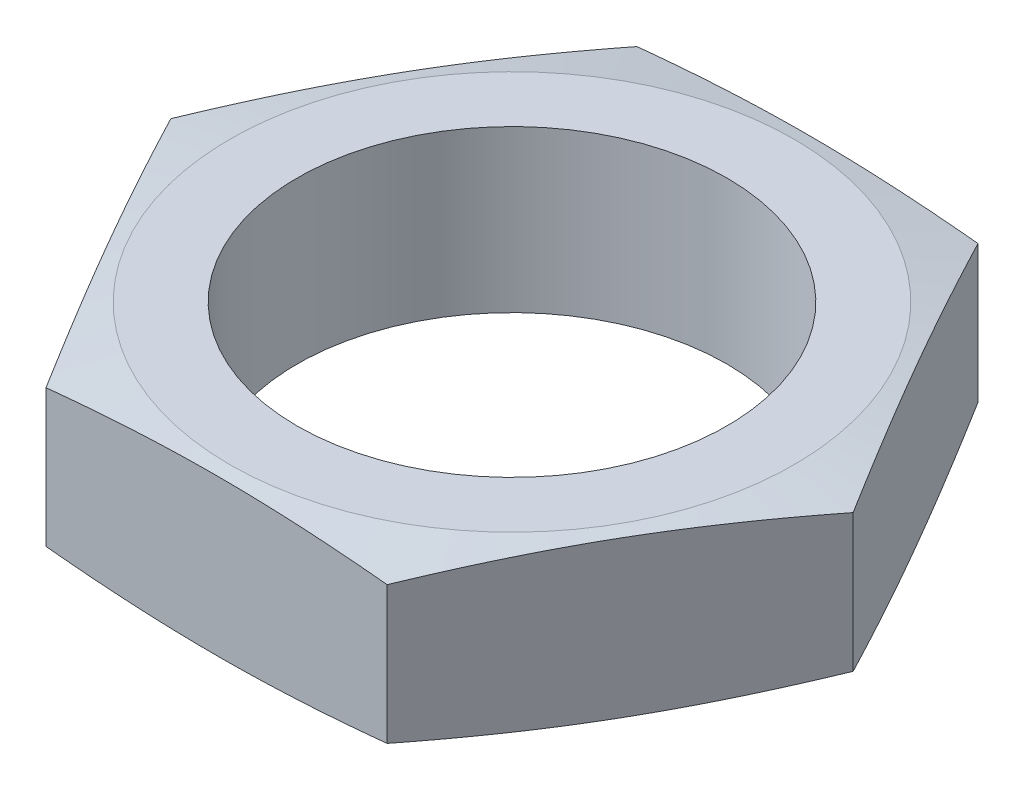
ISO-10303-21;
HEADER;
FILE_DESCRIPTION(('STEP AP214'),'2;1');
FILE_NAME('part.step','',(''),(''),'','','');
FILE_SCHEMA(('AUTOMOTIVE_DESIGN { 1 0 10303 214 1 1 1 1 }'));
ENDSEC;
DATA;
#1=APPLICATION_CONTEXT('core data for automotive mechanical design processes');
#2=APPLICATION_PROTOCOL_DEFINITION('international standard','automotive_design',2000,#1);
#3=PRODUCT_CONTEXT('',#1,'mechanical');
#4=PRODUCT('Part','Part','',(#3));
#5=PRODUCT_RELATED_PRODUCT_CATEGORY('part','',(#4));
#6=PRODUCT_DEFINITION_FORMATION('','',#4);
#7=PRODUCT_DEFINITION_CONTEXT('part definition',#1,'design');
#8=PRODUCT_DEFINITION('design','',#6,#7);
#9=PRODUCT_DEFINITION_SHAPE('','',#8);
#10=(LENGTH_UNIT() NAMED_UNIT(*) SI_UNIT(.MILLI.,.METRE.));
#11=(NAMED_UNIT(*) PLANE_ANGLE_UNIT() SI_UNIT($,.RADIAN.));
#12=(NAMED_UNIT(*) SI_UNIT($,.STERADIAN.) SOLID_ANGLE_UNIT());
#13=UNCERTAINTY_MEASURE_WITH_UNIT(LENGTH_MEASURE(1.E-05),#10,'distance_accuracy_value','');
#14=(GEOMETRIC_REPRESENTATION_CONTEXT(3) GLOBAL_UNCERTAINTY_ASSIGNED_CONTEXT((#13)) GLOBAL_UNIT_ASSIGNED_CONTEXT((#10,
#11,#12)) REPRESENTATION_CONTEXT('',''));
#15=CARTESIAN_POINT('',(0.,0.,0.));
#16=DIRECTION('',(0.,0.,1.));
#17=DIRECTION('',(1.,0.,0.));
#18=AXIS2_PLACEMENT_3D('',#15,#16,#17);
#19=CARTESIAN_POINT('',(0.,3.,0.));
#20=DIRECTION('',(0.,1.,0.));
#21=DIRECTION('',(0.,0.,1.));
#22=AXIS2_PLACEMENT_3D('',#19,#20,#21);
#23=PLANE('',#22);
#24=CARTESIAN_POINT('',(0.,3.,0.));
#25=DIRECTION('',(0.,1.,0.));
#26=DIRECTION('',(0.,0.,1.));
#27=AXIS2_PLACEMENT_3D('',#24,#25,#26);
#28=CIRCLE('',#27,10.5);
#29=CARTESIAN_POINT('',(0.,3.,10.5));
#30=VERTEX_POINT('',#29);
#31=EDGE_CURVE('E122',#30,#30,#28,.T.);
#32=ORIENTED_EDGE('',*,*,#31,.T.);
#33=EDGE_LOOP('',(#32));
#34=FACE_BOUND('',#33,.T.);
#35=CARTESIAN_POINT('',(0.,3.00000000000001,0.));
#36=DIRECTION('',(0.,-1.,0.));
#37=DIRECTION('',(0.,0.,-1.));
#38=AXIS2_PLACEMENT_3D('',#35,#36,#37);
#39=CIRCLE('',#38,7.99999999999999);
#40=CARTESIAN_POINT('',(0.,3.00000000000001,-7.99999999999999));
#41=VERTEX_POINT('',#40);
#42=EDGE_CURVE('E237',#41,#41,#39,.T.);
#43=ORIENTED_EDGE('',*,*,#42,.T.);
#44=EDGE_LOOP('',(#43));
#45=FACE_BOUND('',#44,.T.);
#46=ADVANCED_FACE('F39',(#34,#45),#23,.T.);
#47=CARTESIAN_POINT('',(-6.35085296108588,3.,11.));
#48=DIRECTION('',(0.,0.,-1.));
#49=DIRECTION('',(-1.,0.,0.));
#50=AXIS2_PLACEMENT_3D('',#47,#48,#49);
#51=PLANE('',#50);
#52=CARTESIAN_POINT('',(-16.7722922137977,-1.08846769373587,11.));
#53=CARTESIAN_POINT('',(-16.2731428790611,-1.17192389600639,11.));
#54=CARTESIAN_POINT('',(-15.773815035147,-1.25433135117265,11.));
#55=CARTESIAN_POINT('',(-14.7747162911989,-1.41649136006859,11.));
#56=CARTESIAN_POINT('',(-14.2749453805329,-1.49624384821549,11.));
#57=CARTESIAN_POINT('',(-13.2746248418894,-1.65257520195712,11.));
#58=CARTESIAN_POINT('',(-12.7740749371449,-1.72915230285825,11.));
#59=CARTESIAN_POINT('',(-11.7723848357964,-1.87834077674984,11.));
#60=CARTESIAN_POINT('',(-11.2712446420702,-1.95095216899286,11.));
#61=CARTESIAN_POINT('',(-10.2704536475722,-2.09098072255144,11.));
#62=CARTESIAN_POINT('',(-9.77080582472987,-2.15841906332748,11.));
#63=CARTESIAN_POINT('',(-8.77074083474428,-2.28731659611422,11.));
#64=CARTESIAN_POINT('',(-8.27032367720687,-2.34877586217311,11.));
#65=CARTESIAN_POINT('',(-7.26867167751493,-2.4643498072554,11.));
#66=CARTESIAN_POINT('',(-6.76743689763973,-2.5184650214607,11.));
#67=CARTESIAN_POINT('',(-5.76407587021504,-2.61778612121701,11.));
#68=CARTESIAN_POINT('',(-5.26194962291346,-2.6629920092452,11.));
#69=CARTESIAN_POINT('',(-4.25377044889399,-2.74305795887612,11.));
#70=CARTESIAN_POINT('',(-3.74771228901958,-2.77785305370227,11.));
#71=CARTESIAN_POINT('',(-2.73489238993153,-2.83510361352437,11.));
#72=CARTESIAN_POINT('',(-2.22813065884094,-2.85755921981686,11.));
#73=CARTESIAN_POINT('',(-1.21430051973899,-2.88890136845049,11.));
#74=CARTESIAN_POINT('',(-0.707232213610055,-2.89779114361509,11.));
#75=CARTESIAN_POINT('',(0.306956331119475,-2.90148064036396,11.));
#76=CARTESIAN_POINT('',(0.814076569683894,-2.89628037169709,11.));
#77=CARTESIAN_POINT('',(1.82900611868858,-2.87207936975535,11.));
#78=CARTESIAN_POINT('',(2.33681475195021,-2.85305078227715,11.));
#79=CARTESIAN_POINT('',(3.35178743836292,-2.80223714818586,11.));
#80=CARTESIAN_POINT('',(3.85895148451142,-2.7704519641577,11.));
#81=CARTESIAN_POINT('',(4.87261174495463,-2.69566930387817,11.));
#82=CARTESIAN_POINT('',(5.37910767647204,-2.6526680513658,11.));
#83=CARTESIAN_POINT('',(6.39119527652248,-2.55718152362848,11.));
#84=CARTESIAN_POINT('',(6.89678694316745,-2.50469622862455,11.));
#85=CARTESIAN_POINT('',(7.87840073102163,-2.3950939405448,11.));
#86=CARTESIAN_POINT('',(8.35447159936608,-2.33840922232469,11.));
#87=CARTESIAN_POINT('',(9.30589720015615,-2.21929115381757,11.));
#88=CARTESIAN_POINT('',(9.78125192090888,-2.15685771068027,11.));
#89=CARTESIAN_POINT('',(10.7313410470661,-2.02727503593882,11.));
#90=CARTESIAN_POINT('',(11.2060754176224,-1.96012555010951,11.));
#91=CARTESIAN_POINT('',(12.1549835611179,-1.82196489425272,11.));
#92=CARTESIAN_POINT('',(12.6291573296849,-1.75095369430813,11.));
#93=CARTESIAN_POINT('',(13.5770998048756,-1.60574910918428,11.));
#94=CARTESIAN_POINT('',(14.0508684274322,-1.53155517672329,11.));
#95=CARTESIAN_POINT('',(14.997988638859,-1.38054774151377,11.));
#96=CARTESIAN_POINT('',(15.4713402262632,-1.30373422959378,11.));
#97=CARTESIAN_POINT('',(16.8908239597901,-1.07006339582943,11.));
#98=CARTESIAN_POINT('',(17.8364231580177,-0.909969863418788,11.));
#99=CARTESIAN_POINT('',(19.7213978754908,-0.584652713470203,11.));
#100=CARTESIAN_POINT('',(20.6607791119927,-0.419462002800291,11.));
#101=CARTESIAN_POINT('',(22.5387809886883,-0.0847616117864468,11.));
#102=CARTESIAN_POINT('',(23.4774016205345,0.0847481153130264,11.));
#103=CARTESIAN_POINT('',(25.3533301149125,0.426816406325102,11.));
#104=CARTESIAN_POINT('',(26.2906384304818,0.599372491966795,11.));
#105=CARTESIAN_POINT('',(28.1647819690706,0.946933839393104,11.));
#106=CARTESIAN_POINT('',(29.1016172011011,1.1219390525533,11.));
#107=CARTESIAN_POINT('',(30.0382883250768,1.29780826690031,11.));
#108=B_SPLINE_CURVE_WITH_KNOTS('',3,(#52,#53,#54,#55,#56,#57,#58,#59,#60,#61,#62,#63,#64,#65,
#66,#67,#68,#69,#70,#71,#72,#73,#74,#75,#76,#77,#78,#79,#80,#81,#82,#83,#84,#85,#86,#87,#88,#89,
#90,#91,#92,#93,#94,#95,#96,#97,#98,#99,#100,#101,#102,#103,#104,#105,#106,#107),.UNSPECIFIED.,
.F.,.F.,(4,2,2,2,2,2,2,2,2,2,2,2,2,2,2,2,2,2,2,2,2,2,2,2,2,2,2,4),(0.,1.51823771290291,
3.03651290140394,4.55562084890165,6.07472142084195,7.58722770584801,9.09971525675225,
10.6120925291448,12.1244693810303,13.6460960345534,15.1677052639269,16.6889518275263,
18.21019733858,19.7345155982005,21.2588502783388,22.7836988401997,24.3085505821687,
25.7468102860364,27.1850932239686,28.623453754237,30.0618254292263,31.500445436424,
32.9390704809196,35.8162049637455,38.6775784631281,41.5389829515007,44.3981580934791,
47.2572765503519),.UNSPECIFIED.);
#109=CARTESIAN_POINT('',(6.35085296108589,-2.55965881556565,11.));
#110=VERTEX_POINT('',#109);
#111=CARTESIAN_POINT('',(-6.35085296108588,-2.55965881556565,11.));
#112=VERTEX_POINT('',#111);
#113=EDGE_CURVE('E58',#110,#112,#108,.F.);
#114=ORIENTED_EDGE('',*,*,#113,.F.);
#115=DIRECTION('',(0.,-1.,0.));
#116=VECTOR('',#115,1.);
#117=CARTESIAN_POINT('',(6.35085296108589,3.,11.));
#118=LINE('',#117,#116);
#119=CARTESIAN_POINT('',(6.35085296108589,2.55965881556565,11.));
#120=VERTEX_POINT('',#119);
#121=EDGE_CURVE('E51',#120,#110,#118,.T.);
#122=ORIENTED_EDGE('',*,*,#121,.F.);
#123=CARTESIAN_POINT('',(-16.7722922137977,1.08846769373587,11.));
#124=CARTESIAN_POINT('',(-16.2731428790611,1.17192389600639,11.));
#125=CARTESIAN_POINT('',(-15.773815035147,1.25433135117265,11.));
#126=CARTESIAN_POINT('',(-14.7747162911989,1.41649136006859,11.));
#127=CARTESIAN_POINT('',(-14.2749453805329,1.49624384821549,11.));
#128=CARTESIAN_POINT('',(-13.2746248418894,1.65257520195712,11.));
#129=CARTESIAN_POINT('',(-12.7740749371449,1.72915230285825,11.));
#130=CARTESIAN_POINT('',(-11.7723848357964,1.87834077674984,11.));
#131=CARTESIAN_POINT('',(-11.2712446420702,1.95095216899286,11.));
#132=CARTESIAN_POINT('',(-10.2704536475722,2.09098072255144,11.));
#133=CARTESIAN_POINT('',(-9.77080582472987,2.15841906332748,11.));
#134=CARTESIAN_POINT('',(-8.77074083474428,2.28731659611422,11.));
#135=CARTESIAN_POINT('',(-8.27032367720687,2.34877586217311,11.));
#136=CARTESIAN_POINT('',(-7.26867167751493,2.4643498072554,11.));
#137=CARTESIAN_POINT('',(-6.76743689763973,2.5184650214607,11.));
#138=CARTESIAN_POINT('',(-5.76407587021504,2.61778612121701,11.));
#139=CARTESIAN_POINT('',(-5.26194962291346,2.6629920092452,11.));
#140=CARTESIAN_POINT('',(-4.25377044889399,2.74305795887612,11.));
#141=CARTESIAN_POINT('',(-3.74771228901958,2.77785305370227,11.));
#142=CARTESIAN_POINT('',(-2.73489238993153,2.83510361352437,11.));
#143=CARTESIAN_POINT('',(-2.22813065884094,2.85755921981686,11.));
#144=CARTESIAN_POINT('',(-1.21430051973899,2.88890136845049,11.));
#145=CARTESIAN_POINT('',(-0.707232213610055,2.89779114361509,11.));
#146=CARTESIAN_POINT('',(0.306956331119475,2.90148064036396,11.));
#147=CARTESIAN_POINT('',(0.814076569683894,2.89628037169709,11.));
#148=CARTESIAN_POINT('',(1.82900611868858,2.87207936975535,11.));
#149=CARTESIAN_POINT('',(2.33681475195021,2.85305078227715,11.));
#150=CARTESIAN_POINT('',(3.35178743836292,2.80223714818586,11.));
#151=CARTESIAN_POINT('',(3.85895148451142,2.7704519641577,11.));
#152=CARTESIAN_POINT('',(4.87261174495463,2.69566930387817,11.));
#153=CARTESIAN_POINT('',(5.37910767647204,2.6526680513658,11.));
#154=CARTESIAN_POINT('',(6.39119527652248,2.55718152362848,11.));
#155=CARTESIAN_POINT('',(6.89678694316745,2.50469622862455,11.));
#156=CARTESIAN_POINT('',(7.87840073102163,2.3950939405448,11.));
#157=CARTESIAN_POINT('',(8.35447159936608,2.33840922232469,11.));
#158=CARTESIAN_POINT('',(9.30589720015615,2.21929115381757,11.));
#159=CARTESIAN_POINT('',(9.78125192090888,2.15685771068027,11.));
#160=CARTESIAN_POINT('',(10.7313410470661,2.02727503593882,11.));
#161=CARTESIAN_POINT('',(11.2060754176224,1.96012555010951,11.));
#162=CARTESIAN_POINT('',(12.1549835611179,1.82196489425272,11.));
#163=CARTESIAN_POINT('',(12.6291573296849,1.75095369430813,11.));
#164=CARTESIAN_POINT('',(13.5770998048756,1.60574910918428,11.));
#165=CARTESIAN_POINT('',(14.0508684274322,1.53155517672329,11.));
#166=CARTESIAN_POINT('',(14.997988638859,1.38054774151377,11.));
#167=CARTESIAN_POINT('',(15.4713402262632,1.30373422959378,11.));
#168=CARTESIAN_POINT('',(16.8908239597901,1.07006339582943,11.));
#169=CARTESIAN_POINT('',(17.8364231580177,0.909969863418788,11.));
#170=CARTESIAN_POINT('',(19.7213978754908,0.584652713470203,11.));
#171=CARTESIAN_POINT('',(20.6607791119927,0.419462002800291,11.));
#172=CARTESIAN_POINT('',(22.5387809886883,0.0847616117864468,11.));
#173=CARTESIAN_POINT('',(23.4774016205345,-0.0847481153130264,11.));
#174=CARTESIAN_POINT('',(25.3533301149125,-0.426816406325102,11.));
#175=CARTESIAN_POINT('',(26.2906384304818,-0.599372491966795,11.));
#176=CARTESIAN_POINT('',(28.1647819690706,-0.946933839393104,11.));
#177=CARTESIAN_POINT('',(29.1016172011011,-1.1219390525533,11.));
#178=CARTESIAN_POINT('',(30.0382883250768,-1.29780826690031,11.));
#179=B_SPLINE_CURVE_WITH_KNOTS('',3,(#123,#124,#125,#126,#127,#128,#129,#130,#131,#132,#133,
#134,#135,#136,#137,#138,#139,#140,#141,#142,#143,#144,#145,#146,#147,#148,#149,#150,#151,#152,
#153,#154,#155,#156,#157,#158,#159,#160,#161,#162,#163,#164,#165,#166,#167,#168,#169,#170,#171,
#172,#173,#174,#175,#176,#177,#178),.UNSPECIFIED.,.F.,.F.,(4,2,2,2,2,2,2,2,2,2,2,2,2,2,2,2,2,2,
2,2,2,2,2,2,2,2,2,4),(0.,1.51823771290291,3.03651290140394,4.55562084890165,6.07472142084195,
7.58722770584801,9.09971525675225,10.6120925291448,12.1244693810303,13.6460960345534,
15.1677052639269,16.6889518275263,18.21019733858,19.7345155982005,21.2588502783388,
22.7836988401997,24.3085505821687,25.7468102860364,27.1850932239686,28.623453754237,
30.0618254292263,31.500445436424,32.9390704809196,35.8162049637455,38.6775784631281,
41.5389829515007,44.3981580934791,47.2572765503519),.UNSPECIFIED.);
#180=CARTESIAN_POINT('',(-6.35085296108588,2.55965881556565,11.));
#181=VERTEX_POINT('',#180);
#182=EDGE_CURVE('E191',#181,#120,#179,.T.);
#183=ORIENTED_EDGE('',*,*,#182,.F.);
#184=DIRECTION('',(0.,-1.,0.));
#185=VECTOR('',#184,1.);
#186=CARTESIAN_POINT('',(-6.35085296108588,3.,11.));
#187=LINE('',#186,#185);
#188=EDGE_CURVE('E115',#181,#112,#187,.T.);
#189=ORIENTED_EDGE('',*,*,#188,.T.);
#190=EDGE_LOOP('',(#114,#122,#183,#189));
#191=FACE_BOUND('',#190,.T.);
#192=ADVANCED_FACE('F41',(#191),#51,.F.);
#193=CARTESIAN_POINT('',(6.35085296108589,3.,11.));
#194=DIRECTION('',(-0.866025403784439,0.,-0.5));
#195=DIRECTION('',(-0.5,0.,0.866025403784439));
#196=AXIS2_PLACEMENT_3D('',#193,#194,#195);
#197=PLANE('',#196);
#198=CARTESIAN_POINT('',(12.7018213922256,-2.55963572123997,-0.000200000000004378));
#199=CARTESIAN_POINT('',(12.4376877449327,-2.61248506587701,0.457292897099762));
#200=CARTESIAN_POINT('',(12.1732852687328,-2.66041191030217,0.915251419525077));
#201=CARTESIAN_POINT('',(11.6439595136675,-2.74455346101174,1.83207052105287));
#202=CARTESIAN_POINT('',(11.3790361326985,-2.78076557889539,2.2909312770042));
#203=CARTESIAN_POINT('',(10.849567212286,-2.83950067027059,3.20799834818716));
#204=CARTESIAN_POINT('',(10.5850227887311,-2.8620628466017,3.66620273064335));
#205=CARTESIAN_POINT('',(10.0557453755322,-2.89231173135483,4.5829381016024));
#206=CARTESIAN_POINT('',(9.79101240858053,-2.9,5.0414690508012));
#207=CARTESIAN_POINT('',(9.26154647467713,-2.9,5.9585309491988));
#208=CARTESIAN_POINT('',(8.99681350772543,-2.89231173135483,6.4170618983976));
#209=CARTESIAN_POINT('',(8.46753609452657,-2.8620628466017,7.33379726935665));
#210=CARTESIAN_POINT('',(8.20299167097162,-2.83950067027059,7.79200165181284));
#211=CARTESIAN_POINT('',(7.6735227505592,-2.78076557889539,8.70906872299579));
#212=CARTESIAN_POINT('',(7.40859936959014,-2.74455346101174,9.16792947894713));
#213=CARTESIAN_POINT('',(6.87927361452488,-2.66041191030217,10.0847485804749));
#214=CARTESIAN_POINT('',(6.61487113832494,-2.61248506587701,10.5427071029002));
#215=CARTESIAN_POINT('',(6.35073749103205,-2.55963572123996,11.0002));
#216=B_SPLINE_CURVE_WITH_KNOTS('',3,(#198,#199,#200,#201,#202,#203,#204,#205,#206,#207,#208,
#209,#210,#211,#212,#213,#214,#215),.UNSPECIFIED.,.F.,.F.,(4,2,2,2,2,2,2,2,4),(0.,
1.59275772202257,3.18586712821971,4.77437910673741,6.36272444662769,7.95106978651798,
9.53958176503568,11.1326911712328,12.7254488932554),.UNSPECIFIED.);
#217=CARTESIAN_POINT('',(12.7017059221718,-2.55965881556565,0.));
#218=VERTEX_POINT('',#217);
#219=EDGE_CURVE('E205',#218,#110,#216,.T.);
#220=ORIENTED_EDGE('',*,*,#219,.F.);
#221=DIRECTION('',(0.,-1.,0.));
#222=VECTOR('',#221,1.);
#223=CARTESIAN_POINT('',(12.7017059221718,3.,0.));
#224=LINE('',#223,#222);
#225=CARTESIAN_POINT('',(12.7017059221718,2.55965881556565,0.));
#226=VERTEX_POINT('',#225);
#227=EDGE_CURVE('E129',#226,#218,#224,.T.);
#228=ORIENTED_EDGE('',*,*,#227,.F.);
#229=CARTESIAN_POINT('',(6.35073749103205,2.55963572123997,11.0002));
#230=CARTESIAN_POINT('',(6.61487113832494,2.61248506587701,10.5427071029002));
#231=CARTESIAN_POINT('',(6.87927361452488,2.66041191030217,10.0847485804749));
#232=CARTESIAN_POINT('',(7.40859936959014,2.74455346101174,9.16792947894714));
#233=CARTESIAN_POINT('',(7.6735227505592,2.78076557889539,8.7090687229958));
#234=CARTESIAN_POINT('',(8.20299167097162,2.83950067027059,7.79200165181284));
#235=CARTESIAN_POINT('',(8.46753609452657,2.8620628466017,7.33379726935665));
#236=CARTESIAN_POINT('',(8.99681350772543,2.89231173135483,6.4170618983976));
#237=CARTESIAN_POINT('',(9.26154647467713,2.9,5.9585309491988));
#238=CARTESIAN_POINT('',(9.79101240858053,2.9,5.0414690508012));
#239=CARTESIAN_POINT('',(10.0557453755322,2.89231173135483,4.5829381016024));
#240=CARTESIAN_POINT('',(10.5850227887311,2.8620628466017,3.66620273064335));
#241=CARTESIAN_POINT('',(10.849567212286,2.83950067027059,3.20799834818716));
#242=CARTESIAN_POINT('',(11.3790361326985,2.78076557889539,2.2909312770042));
#243=CARTESIAN_POINT('',(11.6439595136675,2.74455346101174,1.83207052105287));
#244=CARTESIAN_POINT('',(12.1732852687328,2.66041191030217,0.915251419525077));
#245=CARTESIAN_POINT('',(12.4376877449327,2.61248506587701,0.45729289709976));
#246=CARTESIAN_POINT('',(12.7018213922256,2.55963572123997,-0.000200000000004856));
#247=B_SPLINE_CURVE_WITH_KNOTS('',3,(#229,#230,#231,#232,#233,#234,#235,#236,#237,#238,#239,
#240,#241,#242,#243,#244,#245,#246),.UNSPECIFIED.,.F.,.F.,(4,2,2,2,2,2,2,2,4),(0.,
1.59275772202257,3.18586712821971,4.77437910673741,6.36272444662769,7.95106978651798,
9.53958176503568,11.1326911712328,12.7254488932554),.UNSPECIFIED.);
#248=EDGE_CURVE('E184',#120,#226,#247,.T.);
#249=ORIENTED_EDGE('',*,*,#248,.F.);
#250=ORIENTED_EDGE('',*,*,#121,.T.);
#251=EDGE_LOOP('',(#220,#228,#249,#250));
#252=FACE_BOUND('',#251,.T.);
#253=ADVANCED_FACE('F198',(#252),#197,.F.);
#254=CARTESIAN_POINT('',(12.7017059221718,3.,0.));
#255=DIRECTION('',(-0.866025403784439,0.,0.5));
#256=DIRECTION('',(0.5,0.,0.866025403784439));
#257=AXIS2_PLACEMENT_3D('',#254,#255,#256);
#258=PLANE('',#257);
#259=CARTESIAN_POINT('',(6.35073749103205,-2.55963572123996,-11.0002));
#260=CARTESIAN_POINT('',(6.61487113832494,-2.61248506587701,-10.5427071029002));
#261=CARTESIAN_POINT('',(6.87927361452487,-2.66041191030217,-10.0847485804749));
#262=CARTESIAN_POINT('',(7.40859936959013,-2.74455346101174,-9.16792947894713));
#263=CARTESIAN_POINT('',(7.67352275055919,-2.7807655788954,-8.70906872299579));
#264=CARTESIAN_POINT('',(8.20299167097161,-2.83950067027059,-7.79200165181284));
#265=CARTESIAN_POINT('',(8.46753609452656,-2.8620628466017,-7.33379726935664));
#266=CARTESIAN_POINT('',(8.99681350772542,-2.89231173135484,-6.4170618983976));
#267=CARTESIAN_POINT('',(9.26154647467712,-2.9,-5.9585309491988));
#268=CARTESIAN_POINT('',(9.79101240858052,-2.9,-5.0414690508012));
#269=CARTESIAN_POINT('',(10.0557453755322,-2.89231173135484,-4.5829381016024));
#270=CARTESIAN_POINT('',(10.5850227887311,-2.8620628466017,-3.66620273064336));
#271=CARTESIAN_POINT('',(10.849567212286,-2.83950067027059,-3.20799834818716));
#272=CARTESIAN_POINT('',(11.3790361326985,-2.7807655788954,-2.29093127700421));
#273=CARTESIAN_POINT('',(11.6439595136675,-2.74455346101174,-1.83207052105287));
#274=CARTESIAN_POINT('',(12.1732852687328,-2.66041191030218,-0.91525141952508));
#275=CARTESIAN_POINT('',(12.4376877449327,-2.61248506587702,-0.457292897099766));
#276=CARTESIAN_POINT('',(12.7018213922256,-2.55963572123997,0.000199999999995751));
#277=B_SPLINE_CURVE_WITH_KNOTS('',3,(#259,#260,#261,#262,#263,#264,#265,#266,#267,#268,#269,
#270,#271,#272,#273,#274,#275,#276),.UNSPECIFIED.,.F.,.F.,(4,2,2,2,2,2,2,2,4),(0.,
1.59275772202257,3.18586712821971,4.77437910673741,6.36272444662769,7.95106978651797,
9.53958176503567,11.1326911712328,12.7254488932554),.UNSPECIFIED.);
#278=CARTESIAN_POINT('',(6.35085296108588,-2.55965881556565,-11.));
#279=VERTEX_POINT('',#278);
#280=EDGE_CURVE('E213',#279,#218,#277,.T.);
#281=ORIENTED_EDGE('',*,*,#280,.F.);
#282=DIRECTION('',(0.,-1.,0.));
#283=VECTOR('',#282,1.);
#284=CARTESIAN_POINT('',(6.35085296108588,3.,-11.));
#285=LINE('',#284,#283);
#286=CARTESIAN_POINT('',(6.35085296108588,2.55965881556565,-11.));
#287=VERTEX_POINT('',#286);
#288=EDGE_CURVE('E120',#287,#279,#285,.T.);
#289=ORIENTED_EDGE('',*,*,#288,.F.);
#290=CARTESIAN_POINT('',(12.7018213922256,2.55963572123997,0.000199999999996144));
#291=CARTESIAN_POINT('',(12.4376877449327,2.61248506587702,-0.457292897099764));
#292=CARTESIAN_POINT('',(12.1732852687328,2.66041191030218,-0.915251419525079));
#293=CARTESIAN_POINT('',(11.6439595136675,2.74455346101174,-1.83207052105287));
#294=CARTESIAN_POINT('',(11.3790361326985,2.7807655788954,-2.29093127700421));
#295=CARTESIAN_POINT('',(10.849567212286,2.83950067027059,-3.20799834818716));
#296=CARTESIAN_POINT('',(10.5850227887311,2.8620628466017,-3.66620273064336));
#297=CARTESIAN_POINT('',(10.0557453755322,2.89231173135484,-4.5829381016024));
#298=CARTESIAN_POINT('',(9.79101240858052,2.9,-5.0414690508012));
#299=CARTESIAN_POINT('',(9.26154647467712,2.9,-5.9585309491988));
#300=CARTESIAN_POINT('',(8.99681350772542,2.89231173135484,-6.4170618983976));
#301=CARTESIAN_POINT('',(8.46753609452656,2.8620628466017,-7.33379726935664));
#302=CARTESIAN_POINT('',(8.20299167097162,2.83950067027059,-7.79200165181284));
#303=CARTESIAN_POINT('',(7.67352275055919,2.7807655788954,-8.70906872299579));
#304=CARTESIAN_POINT('',(7.40859936959013,2.74455346101174,-9.16792947894713));
#305=CARTESIAN_POINT('',(6.87927361452487,2.66041191030217,-10.0847485804749));
#306=CARTESIAN_POINT('',(6.61487113832493,2.61248506587701,-10.5427071029002));
#307=CARTESIAN_POINT('',(6.35073749103205,2.55963572123996,-11.0002));
#308=B_SPLINE_CURVE_WITH_KNOTS('',3,(#290,#291,#292,#293,#294,#295,#296,#297,#298,#299,#300,
#301,#302,#303,#304,#305,#306,#307),.UNSPECIFIED.,.F.,.F.,(4,2,2,2,2,2,2,2,4),(0.,
1.59275772202257,3.18586712821971,4.77437910673741,6.36272444662769,7.95106978651797,
9.53958176503567,11.1326911712328,12.7254488932554),.UNSPECIFIED.);
#309=EDGE_CURVE('E176',#226,#287,#308,.T.);
#310=ORIENTED_EDGE('',*,*,#309,.F.);
#311=ORIENTED_EDGE('',*,*,#227,.T.);
#312=EDGE_LOOP('',(#281,#289,#310,#311));
#313=FACE_BOUND('',#312,.T.);
#314=ADVANCED_FACE('F201',(#313),#258,.F.);
#315=CARTESIAN_POINT('',(6.35085296108588,3.,-11.));
#316=DIRECTION('',(0.,0.,1.));
#317=DIRECTION('',(1.,0.,0.));
#318=AXIS2_PLACEMENT_3D('',#315,#316,#317);
#319=PLANE('',#318);
#320=CARTESIAN_POINT('',(-16.7722922137977,-1.08846769373587,-11.));
#321=CARTESIAN_POINT('',(-16.2731428790611,-1.17192389600639,-11.));
#322=CARTESIAN_POINT('',(-15.773815035147,-1.25433135117265,-11.));
#323=CARTESIAN_POINT('',(-14.7747162911989,-1.41649136006859,-11.));
#324=CARTESIAN_POINT('',(-14.2749453805329,-1.49624384821549,-11.));
#325=CARTESIAN_POINT('',(-13.2746248418894,-1.65257520195712,-11.));
#326=CARTESIAN_POINT('',(-12.7740749371449,-1.72915230285825,-11.));
#327=CARTESIAN_POINT('',(-11.7723848357964,-1.87834077674985,-11.));
#328=CARTESIAN_POINT('',(-11.2712446420702,-1.95095216899286,-11.));
#329=CARTESIAN_POINT('',(-10.2704536475722,-2.09098072255144,-11.));
#330=CARTESIAN_POINT('',(-9.77080582472987,-2.15841906332748,-11.));
#331=CARTESIAN_POINT('',(-8.77074083474428,-2.28731659611423,-11.));
#332=CARTESIAN_POINT('',(-8.27032367720687,-2.34877586217311,-11.));
#333=CARTESIAN_POINT('',(-7.26867167751493,-2.4643498072554,-11.));
#334=CARTESIAN_POINT('',(-6.76743689763973,-2.5184650214607,-11.));
#335=CARTESIAN_POINT('',(-5.76407587021504,-2.61778612121701,-11.));
#336=CARTESIAN_POINT('',(-5.26194962291346,-2.6629920092452,-11.));
#337=CARTESIAN_POINT('',(-4.25377044889399,-2.74305795887612,-11.));
#338=CARTESIAN_POINT('',(-3.74771228901958,-2.77785305370228,-11.));
#339=CARTESIAN_POINT('',(-2.73489238993153,-2.83510361352437,-11.));
#340=CARTESIAN_POINT('',(-2.22813065884094,-2.85755921981686,-11.));
#341=CARTESIAN_POINT('',(-1.21430051973899,-2.88890136845049,-11.));
#342=CARTESIAN_POINT('',(-0.707232213610056,-2.89779114361509,-11.));
#343=CARTESIAN_POINT('',(0.306956331119473,-2.90148064036396,-11.));
#344=CARTESIAN_POINT('',(0.814076569683891,-2.89628037169709,-11.));
#345=CARTESIAN_POINT('',(1.82900611868858,-2.87207936975535,-11.));
#346=CARTESIAN_POINT('',(2.3368147519502,-2.85305078227715,-11.));
#347=CARTESIAN_POINT('',(3.35178743836291,-2.80223714818586,-11.));
#348=CARTESIAN_POINT('',(3.85895148451141,-2.7704519641577,-11.));
#349=CARTESIAN_POINT('',(4.87261174495463,-2.69566930387817,-11.));
#350=CARTESIAN_POINT('',(5.37910767647203,-2.6526680513658,-11.));
#351=CARTESIAN_POINT('',(6.39119527652247,-2.55718152362847,-11.));
#352=CARTESIAN_POINT('',(6.89678694316744,-2.50469622862455,-11.));
#353=CARTESIAN_POINT('',(7.87840073102162,-2.3950939405448,-11.));
#354=CARTESIAN_POINT('',(8.35447159936607,-2.33840922232469,-11.));
#355=CARTESIAN_POINT('',(9.30589720015614,-2.21929115381756,-11.));
#356=CARTESIAN_POINT('',(9.78125192090887,-2.15685771068027,-11.));
#357=CARTESIAN_POINT('',(10.7313410470661,-2.02727503593882,-11.));
#358=CARTESIAN_POINT('',(11.2060754176224,-1.96012555010951,-11.));
#359=CARTESIAN_POINT('',(12.1549835611179,-1.82196489425272,-11.));
#360=CARTESIAN_POINT('',(12.6291573296849,-1.75095369430813,-11.));
#361=CARTESIAN_POINT('',(13.5770998048756,-1.60574910918428,-11.));
#362=CARTESIAN_POINT('',(14.0508684274322,-1.53155517672329,-11.));
#363=CARTESIAN_POINT('',(14.997988638859,-1.38054774151377,-11.));
#364=CARTESIAN_POINT('',(15.4713402262632,-1.30373422959378,-11.));
#365=CARTESIAN_POINT('',(16.8908239597901,-1.07006339582943,-11.));
#366=CARTESIAN_POINT('',(17.8364231580177,-0.909969863418786,-11.));
#367=CARTESIAN_POINT('',(19.7213978754908,-0.584652713470202,-11.));
#368=CARTESIAN_POINT('',(20.6607791119927,-0.41946200280029,-11.));
#369=CARTESIAN_POINT('',(22.5387809886883,-0.0847616117864463,-11.));
#370=CARTESIAN_POINT('',(23.4774016205345,0.0847481153130269,-11.));
#371=CARTESIAN_POINT('',(25.3533301149124,0.426816406325102,-11.));
#372=CARTESIAN_POINT('',(26.2906384304818,0.599372491966794,-11.));
#373=CARTESIAN_POINT('',(28.1647819690706,0.946933839393103,-11.));
#374=CARTESIAN_POINT('',(29.1016172011011,1.1219390525533,-11.));
#375=CARTESIAN_POINT('',(30.0382883250768,1.29780826690031,-11.));
#376=B_SPLINE_CURVE_WITH_KNOTS('',3,(#320,#321,#322,#323,#324,#325,#326,#327,#328,#329,#330,
#331,#332,#333,#334,#335,#336,#337,#338,#339,#340,#341,#342,#343,#344,#345,#346,#347,#348,#349,
#350,#351,#352,#353,#354,#355,#356,#357,#358,#359,#360,#361,#362,#363,#364,#365,#366,#367,#368,
#369,#370,#371,#372,#373,#374,#375),.UNSPECIFIED.,.F.,.F.,(4,2,2,2,2,2,2,2,2,2,2,2,2,2,2,2,2,2,
2,2,2,2,2,2,2,2,2,4),(0.,1.51823771290291,3.03651290140394,4.55562084890165,6.07472142084195,
7.58722770584801,9.09971525675225,10.6120925291448,12.1244693810303,13.6460960345534,
15.1677052639269,16.6889518275263,18.21019733858,19.7345155982005,21.2588502783388,
22.7836988401997,24.3085505821687,25.7468102860364,27.1850932239686,28.623453754237,
30.0618254292262,31.500445436424,32.9390704809196,35.8162049637455,38.6775784631281,
41.5389829515007,44.3981580934791,47.2572765503519),.UNSPECIFIED.);
#377=CARTESIAN_POINT('',(-6.35085296108588,-2.55965881556565,-11.));
#378=VERTEX_POINT('',#377);
#379=EDGE_CURVE('E111',#378,#279,#376,.T.);
#380=ORIENTED_EDGE('',*,*,#379,.F.);
#381=DIRECTION('',(0.,-1.,0.));
#382=VECTOR('',#381,1.);
#383=CARTESIAN_POINT('',(-6.35085296108588,3.,-11.));
#384=LINE('',#383,#382);
#385=CARTESIAN_POINT('',(-6.35085296108588,2.55965881556565,-11.));
#386=VERTEX_POINT('',#385);
#387=EDGE_CURVE('E109',#386,#378,#384,.T.);
#388=ORIENTED_EDGE('',*,*,#387,.F.);
#389=CARTESIAN_POINT('',(-16.7722922137977,1.08846769373587,-11.));
#390=CARTESIAN_POINT('',(-16.2731428790611,1.17192389600639,-11.));
#391=CARTESIAN_POINT('',(-15.773815035147,1.25433135117265,-11.));
#392=CARTESIAN_POINT('',(-14.7747162911989,1.41649136006859,-11.));
#393=CARTESIAN_POINT('',(-14.2749453805329,1.49624384821549,-11.));
#394=CARTESIAN_POINT('',(-13.2746248418894,1.65257520195712,-11.));
#395=CARTESIAN_POINT('',(-12.7740749371449,1.72915230285825,-11.));
#396=CARTESIAN_POINT('',(-11.7723848357964,1.87834077674985,-11.));
#397=CARTESIAN_POINT('',(-11.2712446420702,1.95095216899286,-11.));
#398=CARTESIAN_POINT('',(-10.2704536475722,2.09098072255144,-11.));
#399=CARTESIAN_POINT('',(-9.77080582472987,2.15841906332748,-11.));
#400=CARTESIAN_POINT('',(-8.77074083474428,2.28731659611423,-11.));
#401=CARTESIAN_POINT('',(-8.27032367720687,2.34877586217311,-11.));
#402=CARTESIAN_POINT('',(-7.26867167751493,2.4643498072554,-11.));
#403=CARTESIAN_POINT('',(-6.76743689763973,2.5184650214607,-11.));
#404=CARTESIAN_POINT('',(-5.76407587021504,2.61778612121701,-11.));
#405=CARTESIAN_POINT('',(-5.26194962291346,2.6629920092452,-11.));
#406=CARTESIAN_POINT('',(-4.25377044889399,2.74305795887612,-11.));
#407=CARTESIAN_POINT('',(-3.74771228901958,2.77785305370228,-11.));
#408=CARTESIAN_POINT('',(-2.73489238993153,2.83510361352437,-11.));
#409=CARTESIAN_POINT('',(-2.22813065884094,2.85755921981686,-11.));
#410=CARTESIAN_POINT('',(-1.21430051973899,2.88890136845049,-11.));
#411=CARTESIAN_POINT('',(-0.707232213610056,2.89779114361509,-11.));
#412=CARTESIAN_POINT('',(0.306956331119473,2.90148064036396,-11.));
#413=CARTESIAN_POINT('',(0.814076569683891,2.89628037169709,-11.));
#414=CARTESIAN_POINT('',(1.82900611868858,2.87207936975535,-11.));
#415=CARTESIAN_POINT('',(2.3368147519502,2.85305078227715,-11.));
#416=CARTESIAN_POINT('',(3.35178743836291,2.80223714818586,-11.));
#417=CARTESIAN_POINT('',(3.85895148451141,2.7704519641577,-11.));
#418=CARTESIAN_POINT('',(4.87261174495463,2.69566930387817,-11.));
#419=CARTESIAN_POINT('',(5.37910767647203,2.6526680513658,-11.));
#420=CARTESIAN_POINT('',(6.39119527652247,2.55718152362847,-11.));
#421=CARTESIAN_POINT('',(6.89678694316744,2.50469622862455,-11.));
#422=CARTESIAN_POINT('',(7.87840073102162,2.3950939405448,-11.));
#423=CARTESIAN_POINT('',(8.35447159936607,2.33840922232469,-11.));
#424=CARTESIAN_POINT('',(9.30589720015614,2.21929115381756,-11.));
#425=CARTESIAN_POINT('',(9.78125192090887,2.15685771068027,-11.));
#426=CARTESIAN_POINT('',(10.7313410470661,2.02727503593882,-11.));
#427=CARTESIAN_POINT('',(11.2060754176224,1.96012555010951,-11.));
#428=CARTESIAN_POINT('',(12.1549835611179,1.82196489425272,-11.));
#429=CARTESIAN_POINT('',(12.6291573296849,1.75095369430813,-11.));
#430=CARTESIAN_POINT('',(13.5770998048756,1.60574910918428,-11.));
#431=CARTESIAN_POINT('',(14.0508684274322,1.53155517672329,-11.));
#432=CARTESIAN_POINT('',(14.997988638859,1.38054774151377,-11.));
#433=CARTESIAN_POINT('',(15.4713402262632,1.30373422959378,-11.));
#434=CARTESIAN_POINT('',(16.8908239597901,1.07006339582943,-11.));
#435=CARTESIAN_POINT('',(17.8364231580177,0.909969863418786,-11.));
#436=CARTESIAN_POINT('',(19.7213978754908,0.584652713470202,-11.));
#437=CARTESIAN_POINT('',(20.6607791119927,0.41946200280029,-11.));
#438=CARTESIAN_POINT('',(22.5387809886883,0.0847616117864463,-11.));
#439=CARTESIAN_POINT('',(23.4774016205345,-0.0847481153130269,-11.));
#440=CARTESIAN_POINT('',(25.3533301149124,-0.426816406325102,-11.));
#441=CARTESIAN_POINT('',(26.2906384304818,-0.599372491966794,-11.));
#442=CARTESIAN_POINT('',(28.1647819690706,-0.946933839393103,-11.));
#443=CARTESIAN_POINT('',(29.1016172011011,-1.1219390525533,-11.));
#444=CARTESIAN_POINT('',(30.0382883250768,-1.29780826690031,-11.));
#445=B_SPLINE_CURVE_WITH_KNOTS('',3,(#389,#390,#391,#392,#393,#394,#395,#396,#397,#398,#399,
#400,#401,#402,#403,#404,#405,#406,#407,#408,#409,#410,#411,#412,#413,#414,#415,#416,#417,#418,
#419,#420,#421,#422,#423,#424,#425,#426,#427,#428,#429,#430,#431,#432,#433,#434,#435,#436,#437,
#438,#439,#440,#441,#442,#443,#444),.UNSPECIFIED.,.F.,.F.,(4,2,2,2,2,2,2,2,2,2,2,2,2,2,2,2,2,2,
2,2,2,2,2,2,2,2,2,4),(0.,1.51823771290291,3.03651290140394,4.55562084890165,6.07472142084195,
7.58722770584801,9.09971525675225,10.6120925291448,12.1244693810303,13.6460960345534,
15.1677052639269,16.6889518275263,18.21019733858,19.7345155982005,21.2588502783388,
22.7836988401997,24.3085505821687,25.7468102860364,27.1850932239686,28.623453754237,
30.0618254292262,31.500445436424,32.9390704809196,35.8162049637455,38.6775784631281,
41.5389829515007,44.3981580934791,47.2572765503519),.UNSPECIFIED.);
#446=EDGE_CURVE('E169',#287,#386,#445,.F.);
#447=ORIENTED_EDGE('',*,*,#446,.F.);
#448=ORIENTED_EDGE('',*,*,#288,.T.);
#449=EDGE_LOOP('',(#380,#388,#447,#448));
#450=FACE_BOUND('',#449,.T.);
#451=ADVANCED_FACE('F256',(#450),#319,.F.);
#452=CARTESIAN_POINT('',(-6.35085296108588,3.,-11.));
#453=DIRECTION('',(0.866025403784439,0.,0.5));
#454=DIRECTION('',(0.5,0.,-0.866025403784439));
#455=AXIS2_PLACEMENT_3D('',#452,#453,#454);
#456=PLANE('',#455);
#457=CARTESIAN_POINT('',(-12.7018213922256,-2.55963572123997,0.000200000000002168));
#458=CARTESIAN_POINT('',(-12.4376877449327,-2.61248506587702,-0.457292897099757));
#459=CARTESIAN_POINT('',(-12.1732852687328,-2.66041191030217,-0.915251419525073));
#460=CARTESIAN_POINT('',(-11.6439595136675,-2.74455346101174,-1.83207052105286));
#461=CARTESIAN_POINT('',(-11.3790361326985,-2.78076557889539,-2.2909312770042));
#462=CARTESIAN_POINT('',(-10.849567212286,-2.83950067027059,-3.20799834818716));
#463=CARTESIAN_POINT('',(-10.5850227887311,-2.8620628466017,-3.66620273064335));
#464=CARTESIAN_POINT('',(-10.0557453755322,-2.89231173135484,-4.58293810160239));
#465=CARTESIAN_POINT('',(-9.79101240858053,-2.9,-5.0414690508012));
#466=CARTESIAN_POINT('',(-9.26154647467712,-2.9,-5.9585309491988));
#467=CARTESIAN_POINT('',(-8.99681350772542,-2.89231173135484,-6.4170618983976));
#468=CARTESIAN_POINT('',(-8.46753609452656,-2.8620628466017,-7.33379726935664));
#469=CARTESIAN_POINT('',(-8.20299167097162,-2.83950067027059,-7.79200165181283));
#470=CARTESIAN_POINT('',(-7.67352275055919,-2.7807655788954,-8.70906872299579));
#471=CARTESIAN_POINT('',(-7.40859936959013,-2.74455346101174,-9.16792947894713));
#472=CARTESIAN_POINT('',(-6.87927361452487,-2.66041191030217,-10.0847485804749));
#473=CARTESIAN_POINT('',(-6.61487113832493,-2.61248506587701,-10.5427071029002));
#474=CARTESIAN_POINT('',(-6.35073749103205,-2.55963572123997,-11.0002));
#475=B_SPLINE_CURVE_WITH_KNOTS('',3,(#457,#458,#459,#460,#461,#462,#463,#464,#465,#466,#467,
#468,#469,#470,#471,#472,#473,#474),.UNSPECIFIED.,.F.,.F.,(4,2,2,2,2,2,2,2,4),(0.,
1.59275772202257,3.18586712821971,4.77437910673741,6.36272444662769,7.95106978651797,
9.53958176503567,11.1326911712328,12.7254488932554),.UNSPECIFIED.);
#476=CARTESIAN_POINT('',(-12.7017059221718,-2.55965881556565,0.));
#477=VERTEX_POINT('',#476);
#478=EDGE_CURVE('E95',#477,#378,#475,.T.);
#479=ORIENTED_EDGE('',*,*,#478,.F.);
#480=DIRECTION('',(0.,-1.,0.));
#481=VECTOR('',#480,1.);
#482=CARTESIAN_POINT('',(-12.7017059221718,3.,0.));
#483=LINE('',#482,#481);
#484=CARTESIAN_POINT('',(-12.7017059221718,2.55965881556565,0.));
#485=VERTEX_POINT('',#484);
#486=EDGE_CURVE('E107',#485,#477,#483,.T.);
#487=ORIENTED_EDGE('',*,*,#486,.F.);
#488=CARTESIAN_POINT('',(-6.35073749103205,2.55963572123997,-11.0002));
#489=CARTESIAN_POINT('',(-6.61487113832493,2.61248506587701,-10.5427071029002));
#490=CARTESIAN_POINT('',(-6.87927361452487,2.66041191030217,-10.0847485804749));
#491=CARTESIAN_POINT('',(-7.40859936959013,2.74455346101174,-9.16792947894713));
#492=CARTESIAN_POINT('',(-7.67352275055919,2.7807655788954,-8.70906872299579));
#493=CARTESIAN_POINT('',(-8.20299167097162,2.83950067027059,-7.79200165181283));
#494=CARTESIAN_POINT('',(-8.46753609452656,2.8620628466017,-7.33379726935664));
#495=CARTESIAN_POINT('',(-8.99681350772542,2.89231173135484,-6.4170618983976));
#496=CARTESIAN_POINT('',(-9.26154647467712,2.9,-5.9585309491988));
#497=CARTESIAN_POINT('',(-9.79101240858053,2.9,-5.04146905080119));
#498=CARTESIAN_POINT('',(-10.0557453755322,2.89231173135484,-4.58293810160239));
#499=CARTESIAN_POINT('',(-10.5850227887311,2.8620628466017,-3.66620273064335));
#500=CARTESIAN_POINT('',(-10.849567212286,2.83950067027059,-3.20799834818716));
#501=CARTESIAN_POINT('',(-11.3790361326985,2.78076557889539,-2.2909312770042));
#502=CARTESIAN_POINT('',(-11.6439595136675,2.74455346101174,-1.83207052105286));
#503=CARTESIAN_POINT('',(-12.1732852687328,2.66041191030217,-0.915251419525073));
#504=CARTESIAN_POINT('',(-12.4376877449327,2.61248506587702,-0.457292897099758));
#505=CARTESIAN_POINT('',(-12.7018213922256,2.55963572123997,0.000200000000001632));
#506=B_SPLINE_CURVE_WITH_KNOTS('',3,(#488,#489,#490,#491,#492,#493,#494,#495,#496,#497,#498,
#499,#500,#501,#502,#503,#504,#505),.UNSPECIFIED.,.F.,.F.,(4,2,2,2,2,2,2,2,4),(0.,
1.59275772202257,3.18586712821971,4.77437910673741,6.36272444662769,7.95106978651798,
9.53958176503568,11.1326911712328,12.7254488932554),.UNSPECIFIED.);
#507=EDGE_CURVE('E65',#386,#485,#506,.T.);
#508=ORIENTED_EDGE('',*,*,#507,.F.);
#509=ORIENTED_EDGE('',*,*,#387,.T.);
#510=EDGE_LOOP('',(#479,#487,#508,#509));
#511=FACE_BOUND('',#510,.T.);
#512=ADVANCED_FACE('F106',(#511),#456,.F.);
#513=CARTESIAN_POINT('',(-12.7017059221718,3.,0.));
#514=DIRECTION('',(0.866025403784438,0.,-0.5));
#515=DIRECTION('',(-0.5,0.,-0.866025403784439));
#516=AXIS2_PLACEMENT_3D('',#513,#514,#515);
#517=PLANE('',#516);
#518=CARTESIAN_POINT('',(-6.35073749103204,-2.55963572123997,11.0002));
#519=CARTESIAN_POINT('',(-6.61487113832493,-2.61248506587701,10.5427071029002));
#520=CARTESIAN_POINT('',(-6.87927361452486,-2.66041191030217,10.0847485804749));
#521=CARTESIAN_POINT('',(-7.40859936959012,-2.74455346101174,9.16792947894713));
#522=CARTESIAN_POINT('',(-7.67352275055918,-2.7807655788954,8.70906872299579));
#523=CARTESIAN_POINT('',(-8.20299167097161,-2.83950067027059,7.79200165181284));
#524=CARTESIAN_POINT('',(-8.46753609452656,-2.8620628466017,7.33379726935665));
#525=CARTESIAN_POINT('',(-8.99681350772541,-2.89231173135484,6.4170618983976));
#526=CARTESIAN_POINT('',(-9.26154647467711,-2.9,5.9585309491988));
#527=CARTESIAN_POINT('',(-9.79101240858052,-2.9,5.0414690508012));
#528=CARTESIAN_POINT('',(-10.0557453755322,-2.89231173135484,4.5829381016024));
#529=CARTESIAN_POINT('',(-10.5850227887311,-2.8620628466017,3.66620273064336));
#530=CARTESIAN_POINT('',(-10.849567212286,-2.83950067027059,3.20799834818716));
#531=CARTESIAN_POINT('',(-11.3790361326984,-2.7807655788954,2.29093127700421));
#532=CARTESIAN_POINT('',(-11.6439595136675,-2.74455346101174,1.83207052105287));
#533=CARTESIAN_POINT('',(-12.1732852687328,-2.66041191030218,0.915251419525079));
#534=CARTESIAN_POINT('',(-12.4376877449327,-2.61248506587702,0.457292897099764));
#535=CARTESIAN_POINT('',(-12.7018213922256,-2.55963572123997,-0.000199999999996741));
#536=B_SPLINE_CURVE_WITH_KNOTS('',3,(#518,#519,#520,#521,#522,#523,#524,#525,#526,#527,#528,
#529,#530,#531,#532,#533,#534,#535),.UNSPECIFIED.,.F.,.F.,(4,2,2,2,2,2,2,2,4),(0.,
1.59275772202257,3.18586712821971,4.77437910673741,6.36272444662769,7.95106978651798,
9.53958176503568,11.1326911712328,12.7254488932554),.UNSPECIFIED.);
#537=EDGE_CURVE('E92',#112,#477,#536,.T.);
#538=ORIENTED_EDGE('',*,*,#537,.F.);
#539=ORIENTED_EDGE('',*,*,#188,.F.);
#540=CARTESIAN_POINT('',(-12.7018213922256,2.55963572123997,-0.000199999999997869));
#541=CARTESIAN_POINT('',(-12.4376877449327,2.61248506587701,0.457292897099762));
#542=CARTESIAN_POINT('',(-12.1732852687328,2.66041191030217,0.915251419525077));
#543=CARTESIAN_POINT('',(-11.6439595136675,2.74455346101174,1.83207052105287));
#544=CARTESIAN_POINT('',(-11.3790361326984,2.7807655788954,2.29093127700421));
#545=CARTESIAN_POINT('',(-10.849567212286,2.83950067027059,3.20799834818716));
#546=CARTESIAN_POINT('',(-10.5850227887311,2.8620628466017,3.66620273064336));
#547=CARTESIAN_POINT('',(-10.0557453755322,2.89231173135484,4.5829381016024));
#548=CARTESIAN_POINT('',(-9.79101240858052,2.9,5.0414690508012));
#549=CARTESIAN_POINT('',(-9.26154647467711,2.9,5.9585309491988));
#550=CARTESIAN_POINT('',(-8.99681350772541,2.89231173135484,6.4170618983976));
#551=CARTESIAN_POINT('',(-8.46753609452656,2.8620628466017,7.33379726935665));
#552=CARTESIAN_POINT('',(-8.20299167097161,2.83950067027059,7.79200165181284));
#553=CARTESIAN_POINT('',(-7.67352275055918,2.7807655788954,8.70906872299579));
#554=CARTESIAN_POINT('',(-7.40859936959012,2.74455346101174,9.16792947894713));
#555=CARTESIAN_POINT('',(-6.87927361452486,2.66041191030217,10.0847485804749));
#556=CARTESIAN_POINT('',(-6.61487113832493,2.61248506587701,10.5427071029002));
#557=CARTESIAN_POINT('',(-6.35073749103204,2.55963572123997,11.0002));
#558=B_SPLINE_CURVE_WITH_KNOTS('',3,(#540,#541,#542,#543,#544,#545,#546,#547,#548,#549,#550,
#551,#552,#553,#554,#555,#556,#557),.UNSPECIFIED.,.F.,.F.,(4,2,2,2,2,2,2,2,4),(0.,
1.59275772202257,3.18586712821971,4.77437910673741,6.3627244466277,7.95106978651798,
9.53958176503568,11.1326911712328,12.7254488932554),.UNSPECIFIED.);
#559=EDGE_CURVE('E12',#485,#181,#558,.T.);
#560=ORIENTED_EDGE('',*,*,#559,.F.);
#561=ORIENTED_EDGE('',*,*,#486,.T.);
#562=EDGE_LOOP('',(#538,#539,#560,#561));
#563=FACE_BOUND('',#562,.T.);
#564=ADVANCED_FACE('F113',(#563),#517,.F.);
#565=CARTESIAN_POINT('',(0.,-3.,0.));
#566=DIRECTION('',(0.,1.,0.));
#567=DIRECTION('',(0.,0.,1.));
#568=AXIS2_PLACEMENT_3D('',#565,#566,#567);
#569=PLANE('',#568);
#570=CARTESIAN_POINT('',(0.,-3.,0.));
#571=DIRECTION('',(0.,-1.,0.));
#572=DIRECTION('',(0.,0.,-1.));
#573=AXIS2_PLACEMENT_3D('',#570,#571,#572);
#574=CIRCLE('',#573,7.99999999999999);
#575=CARTESIAN_POINT('',(0.,-3.,-7.99999999999999));
#576=VERTEX_POINT('',#575);
#577=EDGE_CURVE('E281',#576,#576,#574,.T.);
#578=ORIENTED_EDGE('',*,*,#577,.F.);
#579=EDGE_LOOP('',(#578));
#580=FACE_BOUND('',#579,.T.);
#581=CARTESIAN_POINT('',(0.,-3.,0.));
#582=DIRECTION('',(0.,1.,0.));
#583=DIRECTION('',(0.,0.,1.));
#584=AXIS2_PLACEMENT_3D('',#581,#582,#583);
#585=CIRCLE('',#584,10.5);
#586=CARTESIAN_POINT('',(0.,-3.,10.5));
#587=VERTEX_POINT('',#586);
#588=EDGE_CURVE('E44',#587,#587,#585,.T.);
#589=ORIENTED_EDGE('',*,*,#588,.F.);
#590=EDGE_LOOP('',(#589));
#591=FACE_BOUND('',#590,.T.);
#592=ADVANCED_FACE('F151',(#580,#591),#569,.F.);
#593=CARTESIAN_POINT('',(0.,3.5,0.));
#594=DIRECTION('',(0.,-1.,0.));
#595=DIRECTION('',(0.,0.,-1.));
#596=AXIS2_PLACEMENT_3D('',#593,#594,#595);
#597=CONICAL_SURFACE('',#596,8.,1.37340076694502);
#598=ORIENTED_EDGE('',*,*,#31,.F.);
#599=EDGE_LOOP('',(#598));
#600=FACE_BOUND('',#599,.T.);
#601=ORIENTED_EDGE('',*,*,#182,.T.);
#602=ORIENTED_EDGE('',*,*,#248,.T.);
#603=ORIENTED_EDGE('',*,*,#309,.T.);
#604=ORIENTED_EDGE('',*,*,#446,.T.);
#605=ORIENTED_EDGE('',*,*,#507,.T.);
#606=ORIENTED_EDGE('',*,*,#559,.T.);
#607=EDGE_LOOP('',(#601,#602,#603,#604,#605,#606));
#608=FACE_BOUND('',#607,.T.);
#609=ADVANCED_FACE('F146',(#600,#608),#597,.T.);
#610=CARTESIAN_POINT('',(0.,-3.5,0.));
#611=DIRECTION('',(0.,1.,0.));
#612=DIRECTION('',(0.,0.,-1.));
#613=AXIS2_PLACEMENT_3D('',#610,#611,#612);
#614=CONICAL_SURFACE('',#613,8.,1.37340076694502);
#615=ORIENTED_EDGE('',*,*,#588,.T.);
#616=EDGE_LOOP('',(#615));
#617=FACE_BOUND('',#616,.T.);
#618=ORIENTED_EDGE('',*,*,#113,.T.);
#619=ORIENTED_EDGE('',*,*,#537,.T.);
#620=ORIENTED_EDGE('',*,*,#478,.T.);
#621=ORIENTED_EDGE('',*,*,#379,.T.);
#622=ORIENTED_EDGE('',*,*,#280,.T.);
#623=ORIENTED_EDGE('',*,*,#219,.T.);
#624=EDGE_LOOP('',(#618,#619,#620,#621,#622,#623));
#625=FACE_BOUND('',#624,.T.);
#626=ADVANCED_FACE('F94',(#617,#625),#614,.T.);
#627=CARTESIAN_POINT('',(0.,-3.,0.));
#628=DIRECTION('',(0.,-1.,0.));
#629=DIRECTION('',(0.,0.,-1.));
#630=AXIS2_PLACEMENT_3D('',#627,#628,#629);
#631=CYLINDRICAL_SURFACE('',#630,7.99999999999999);
#632=ORIENTED_EDGE('',*,*,#42,.F.);
#633=EDGE_LOOP('',(#632));
#634=FACE_BOUND('',#633,.T.);
#635=ORIENTED_EDGE('',*,*,#577,.T.);
#636=EDGE_LOOP('',(#635));
#637=FACE_BOUND('',#636,.T.);
#638=ADVANCED_FACE('F287',(#634,#637),#631,.F.);
#639=CLOSED_SHELL('',(#46,#192,#253,#314,#451,#512,#564,#592,#609,#626,#638));
#640=MANIFOLD_SOLID_BREP('B2',#639);
#641=ADVANCED_BREP_SHAPE_REPRESENTATION('',(#18,#640),#14);
#642=SHAPE_DEFINITION_REPRESENTATION(#9,#641);
ENDSEC;
END-ISO-10303-21;
